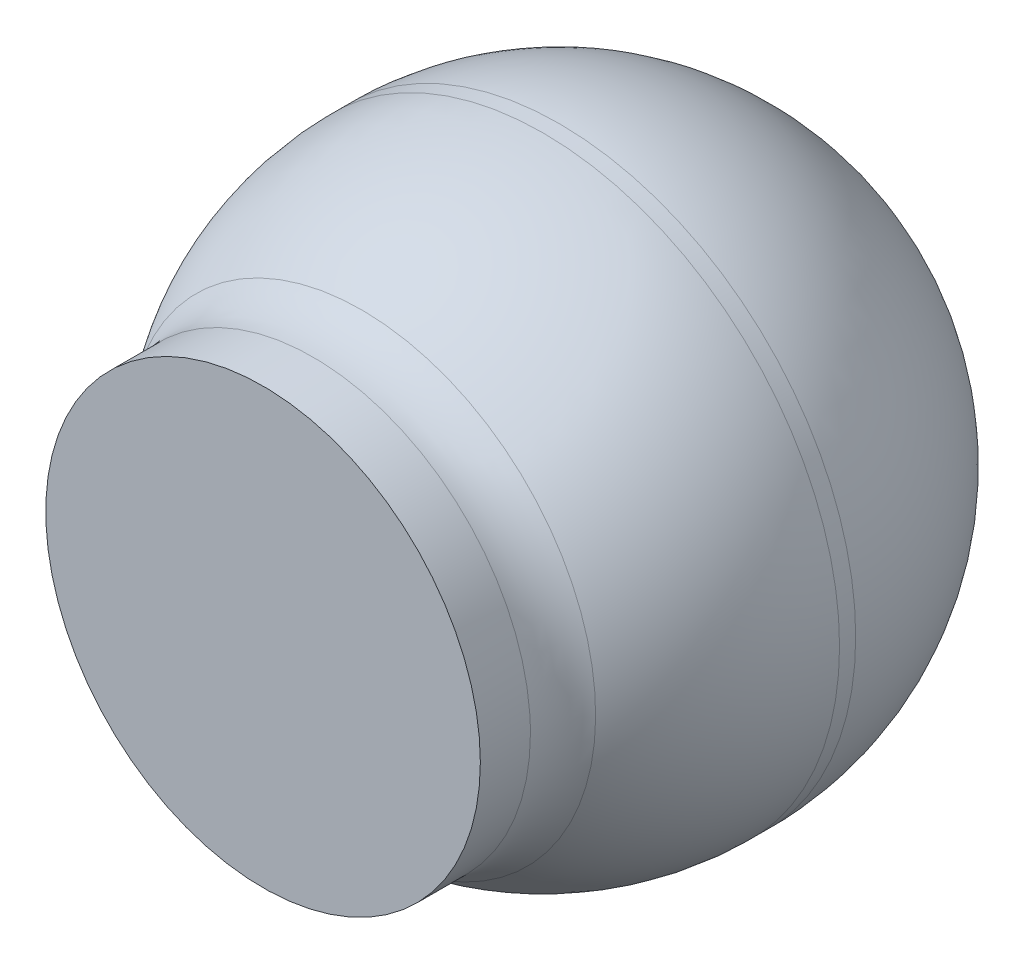
ISO-10303-21;
HEADER;
FILE_DESCRIPTION(('STEP AP214'),'2;1');
FILE_NAME('part.step','',(''),(''),'','','');
FILE_SCHEMA(('AUTOMOTIVE_DESIGN { 1 0 10303 214 1 1 1 1 }'));
ENDSEC;
DATA;
#1=APPLICATION_CONTEXT('core data for automotive mechanical design processes');
#2=APPLICATION_PROTOCOL_DEFINITION('international standard','automotive_design',2000,#1);
#3=PRODUCT_CONTEXT('',#1,'mechanical');
#4=PRODUCT('Part','Part','',(#3));
#5=PRODUCT_RELATED_PRODUCT_CATEGORY('part','',(#4));
#6=PRODUCT_DEFINITION_FORMATION('','',#4);
#7=PRODUCT_DEFINITION_CONTEXT('part definition',#1,'design');
#8=PRODUCT_DEFINITION('design','',#6,#7);
#9=PRODUCT_DEFINITION_SHAPE('','',#8);
#10=(LENGTH_UNIT() NAMED_UNIT(*) SI_UNIT(.MILLI.,.METRE.));
#11=(NAMED_UNIT(*) PLANE_ANGLE_UNIT() SI_UNIT($,.RADIAN.));
#12=(NAMED_UNIT(*) SI_UNIT($,.STERADIAN.) SOLID_ANGLE_UNIT());
#13=UNCERTAINTY_MEASURE_WITH_UNIT(LENGTH_MEASURE(1.E-05),#10,'distance_accuracy_value','');
#14=(GEOMETRIC_REPRESENTATION_CONTEXT(3) GLOBAL_UNCERTAINTY_ASSIGNED_CONTEXT((#13)) GLOBAL_UNIT_ASSIGNED_CONTEXT((#10,
#11,#12)) REPRESENTATION_CONTEXT('',''));
#15=CARTESIAN_POINT('',(0.,0.,0.));
#16=DIRECTION('',(0.,0.,1.));
#17=DIRECTION('',(1.,0.,0.));
#18=AXIS2_PLACEMENT_3D('',#15,#16,#17);
#19=CARTESIAN_POINT('',(-3.102919922269,-11.67134929145,10.006534503384));
#20=DIRECTION('',(0.,0.,-1.));
#21=DIRECTION('',(-1.,0.,0.));
#22=AXIS2_PLACEMENT_3D('',#19,#20,#21);
#23=PLANE('',#22);
#24=CARTESIAN_POINT('',(-3.102919922269,-11.67134929145,10.006534503384));
#25=DIRECTION('',(0.,0.,1.));
#26=DIRECTION('',(1.,0.,0.));
#27=AXIS2_PLACEMENT_3D('',#24,#25,#26);
#28=CIRCLE('',#27,0.275);
#29=CARTESIAN_POINT('',(-2.827919922269,-11.67134929145,10.006534503384));
#30=VERTEX_POINT('',#29);
#31=EDGE_CURVE('E20',#30,#30,#28,.F.);
#32=ORIENTED_EDGE('',*,*,#31,.F.);
#33=EDGE_LOOP('',(#32));
#34=FACE_BOUND('',#33,.T.);
#35=ADVANCED_FACE('F17',(#34),#23,.F.);
#36=CARTESIAN_POINT('',(-3.102919922269,-11.67134929145,9.906534503384));
#37=DIRECTION('',(0.,0.,1.));
#38=DIRECTION('',(1.,0.,0.));
#39=AXIS2_PLACEMENT_3D('',#36,#37,#38);
#40=CYLINDRICAL_SURFACE('',#39,0.275);
#41=CARTESIAN_POINT('',(-3.102919922269,-11.67134929145,9.943180457728));
#42=DIRECTION('',(0.,0.,-1.));
#43=DIRECTION('',(0.996700902337582,0.081162252799247,0.));
#44=AXIS2_PLACEMENT_3D('',#41,#42,#43);
#45=CIRCLE('',#44,0.275);
#46=CARTESIAN_POINT('',(-2.82882717412616,-11.6490296719302,9.943180457728));
#47=VERTEX_POINT('',#46);
#48=EDGE_CURVE('E66',#47,#47,#45,.F.);
#49=ORIENTED_EDGE('',*,*,#48,.T.);
#50=EDGE_LOOP('',(#49));
#51=FACE_BOUND('',#50,.T.);
#52=ORIENTED_EDGE('',*,*,#31,.T.);
#53=EDGE_LOOP('',(#52));
#54=FACE_BOUND('',#53,.T.);
#55=ADVANCED_FACE('F62',(#51,#54),#40,.T.);
#56=CARTESIAN_POINT('',(-3.102919922269,-11.67134929145,9.943180457728));
#57=DIRECTION('',(0.,0.,-1.));
#58=DIRECTION('',(0.996700902337583,0.0811622527992448,0.));
#59=AXIS2_PLACEMENT_3D('',#56,#57,#58);
#60=TOROIDAL_SURFACE('',#59,0.375,0.1);
#61=ORIENTED_EDGE('',*,*,#48,.F.);
#62=EDGE_LOOP('',(#61));
#63=FACE_BOUND('',#62,.T.);
#64=CARTESIAN_POINT('',(-3.102919922269,-11.67134929145,9.881744931236));
#65=DIRECTION('',(0.,0.,-1.));
#66=DIRECTION('',(-0.996700902338691,-0.0811622527856353,0.));
#67=AXIS2_PLACEMENT_3D('',#64,#65,#66);
#68=CIRCLE('',#67,0.29609704641234);
#69=CARTESIAN_POINT('',(-3.398040115608,-11.69538119478,9.881744931236));
#70=VERTEX_POINT('',#69);
#71=EDGE_CURVE('E39',#70,#70,#68,.T.);
#72=ORIENTED_EDGE('',*,*,#71,.F.);
#73=EDGE_LOOP('',(#72));
#74=FACE_BOUND('',#73,.T.);
#75=ADVANCED_FACE('F57',(#63,#74),#60,.F.);
#76=CARTESIAN_POINT('',(-3.476682760645,-11.70178513625,9.651976062157));
#77=CARTESIAN_POINT('',(-3.476682760645,-11.70178513625,9.701461392103));
#78=CARTESIAN_POINT('',(-3.468526217348,-11.70112094157,9.750947004335));
#79=CARTESIAN_POINT('',(-3.452207085349,-11.69979205995,9.798626332798));
#80=CARTESIAN_POINT('',(-3.428341390838,-11.69784865493,9.842699544317));
#81=CARTESIAN_POINT('',(-3.398040115608,-11.69538119478,9.881744931236));
#82=(BOUNDED_CURVE() B_SPLINE_CURVE(5,(#76,#77,#78,#79,#80,#81),.UNSPECIFIED.,.F.,
.F.) B_SPLINE_CURVE_WITH_KNOTS((6,6),(0.,0.661568582165),
.UNSPECIFIED.) CURVE() GEOMETRIC_REPRESENTATION_ITEM() RATIONAL_B_SPLINE_CURVE((1.,1.,1.,1.,1.,1.)) REPRESENTATION_ITEM(''));
#83=CARTESIAN_POINT('',(-3.102919922269,-11.67134929145,9.651976062157));
#84=DIRECTION('',(0.,0.,-1.));
#85=AXIS1_PLACEMENT('',#83,#84);
#86=SURFACE_OF_REVOLUTION('',#82,#85);
#87=CARTESIAN_POINT('',(-3.102919922269,-11.67134929145,9.651976062157));
#88=DIRECTION('',(0.,0.,1.));
#89=DIRECTION('',(1.,0.,0.));
#90=AXIS2_PLACEMENT_3D('',#87,#88,#89);
#91=CIRCLE('',#90,0.375);
#92=CARTESIAN_POINT('',(-2.727919922269,-11.67134929145,9.651976062157));
#93=VERTEX_POINT('',#92);
#94=EDGE_CURVE('E36',#93,#93,#91,.F.);
#95=ORIENTED_EDGE('',*,*,#94,.F.);
#96=EDGE_LOOP('',(#95));
#97=FACE_BOUND('',#96,.T.);
#98=ORIENTED_EDGE('',*,*,#71,.T.);
#99=EDGE_LOOP('',(#98));
#100=FACE_BOUND('',#99,.T.);
#101=ADVANCED_FACE('F53',(#97,#100),#86,.F.);
#102=CARTESIAN_POINT('',(-3.102919922269,-11.67134929145,9.256534503384));
#103=DIRECTION('',(0.,0.,1.));
#104=DIRECTION('',(1.,0.,0.));
#105=AXIS2_PLACEMENT_3D('',#102,#103,#104);
#106=CYLINDRICAL_SURFACE('',#105,0.375);
#107=CARTESIAN_POINT('',(-3.102919922269,-11.67134929145,9.631534503384));
#108=DIRECTION('',(0.,0.,-1.));
#109=DIRECTION('',(0.0811622527992357,-0.996700902337583,0.));
#110=AXIS2_PLACEMENT_3D('',#107,#108,#109);
#111=CIRCLE('',#110,0.375);
#112=CARTESIAN_POINT('',(-3.07248407746929,-12.0451121298266,9.631534503384));
#113=VERTEX_POINT('',#112);
#114=CARTESIAN_POINT('',(-3.13335576706871,-11.2975864530734,9.631534503384));
#115=VERTEX_POINT('',#114);
#116=EDGE_CURVE('E11',#113,#115,#111,.T.);
#117=ORIENTED_EDGE('',*,*,#116,.F.);
#118=CARTESIAN_POINT('',(-3.102919922269,-11.67134929145,9.631534503384));
#119=DIRECTION('',(3.33436315446763E-12,2.72100352061447E-13,1.));
#120=DIRECTION('',(0.0811622527992365,-0.996700902337583,0.));
#121=AXIS2_PLACEMENT_3D('',#118,#119,#120);
#122=CIRCLE('',#121,0.375);
#123=EDGE_CURVE('E25',#115,#113,#122,.F.);
#124=ORIENTED_EDGE('',*,*,#123,.F.);
#125=EDGE_LOOP('',(#117,#124));
#126=FACE_BOUND('',#125,.T.);
#127=ORIENTED_EDGE('',*,*,#94,.T.);
#128=EDGE_LOOP('',(#127));
#129=FACE_BOUND('',#128,.T.);
#130=ADVANCED_FACE('F34',(#126,#129),#106,.T.);
#131=CARTESIAN_POINT('',(-3.102919922269,-11.67134929145,9.631534503384));
#132=DIRECTION('',(0.0811622527992361,-0.996700902337583,0.));
#133=DIRECTION('',(-0.996700902337583,-0.0811622527992361,0.));
#134=AXIS2_PLACEMENT_3D('',#131,#132,#133);
#135=SPHERICAL_SURFACE('',#134,0.375);
#136=ORIENTED_EDGE('',*,*,#123,.T.);
#137=ORIENTED_EDGE('',*,*,#116,.T.);
#138=EDGE_LOOP('',(#136,#137));
#139=FACE_BOUND('',#138,.T.);
#140=ADVANCED_FACE('F32',(#139),#135,.T.);
#141=CLOSED_SHELL('',(#35,#55,#75,#101,#130,#140));
#142=MANIFOLD_SOLID_BREP('B1',#141);
#143=ADVANCED_BREP_SHAPE_REPRESENTATION('',(#18,#142),#14);
#144=SHAPE_DEFINITION_REPRESENTATION(#9,#143);
ENDSEC;
END-ISO-10303-21;
